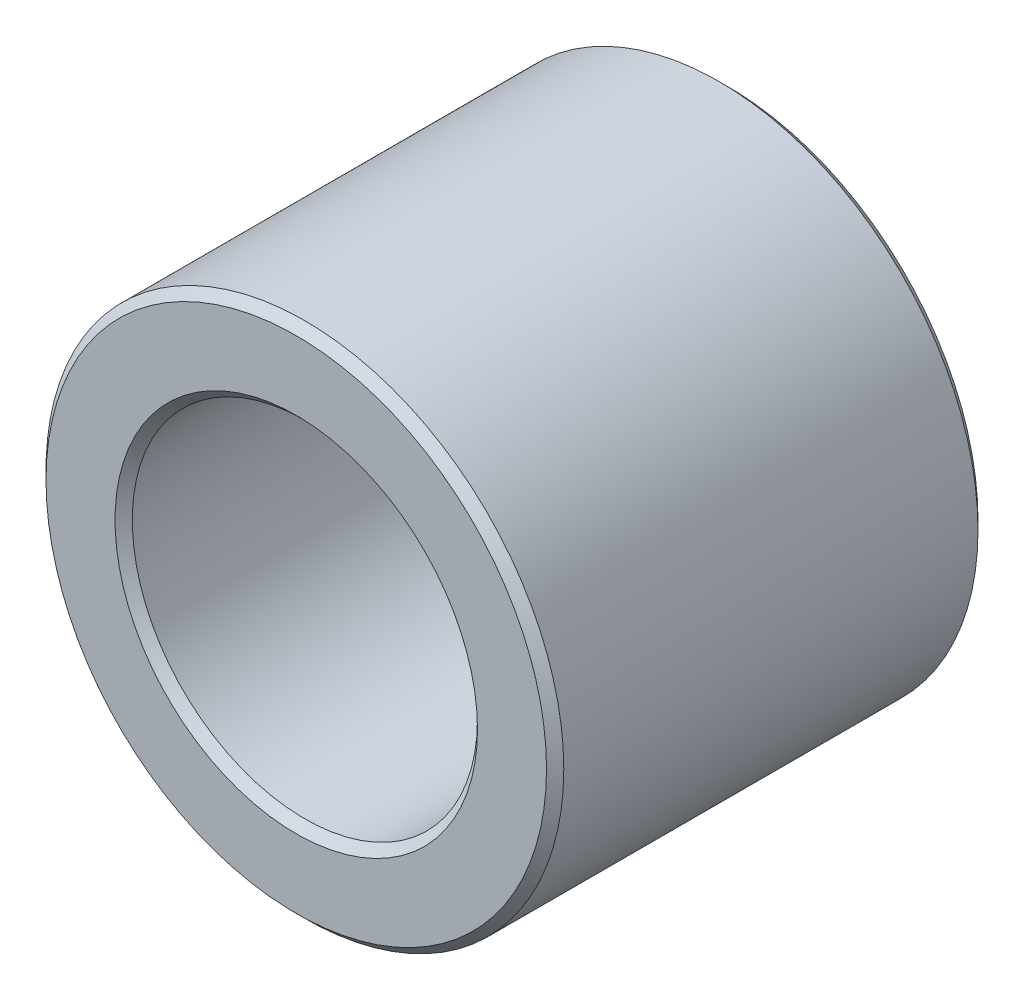
ISO-10303-21;
HEADER;
FILE_DESCRIPTION(('STEP AP214'),'2;1');
FILE_NAME('part.step','',(''),(''),'','','');
FILE_SCHEMA(('AUTOMOTIVE_DESIGN { 1 0 10303 214 1 1 1 1 }'));
ENDSEC;
DATA;
#1=APPLICATION_CONTEXT('core data for automotive mechanical design processes');
#2=APPLICATION_PROTOCOL_DEFINITION('international standard','automotive_design',2000,#1);
#3=PRODUCT_CONTEXT('',#1,'mechanical');
#4=PRODUCT('Part','Part','',(#3));
#5=PRODUCT_RELATED_PRODUCT_CATEGORY('part','',(#4));
#6=PRODUCT_DEFINITION_FORMATION('','',#4);
#7=PRODUCT_DEFINITION_CONTEXT('part definition',#1,'design');
#8=PRODUCT_DEFINITION('design','',#6,#7);
#9=PRODUCT_DEFINITION_SHAPE('','',#8);
#10=(LENGTH_UNIT() NAMED_UNIT(*) SI_UNIT(.MILLI.,.METRE.));
#11=(NAMED_UNIT(*) PLANE_ANGLE_UNIT() SI_UNIT($,.RADIAN.));
#12=(NAMED_UNIT(*) SI_UNIT($,.STERADIAN.) SOLID_ANGLE_UNIT());
#13=UNCERTAINTY_MEASURE_WITH_UNIT(LENGTH_MEASURE(1.E-05),#10,'distance_accuracy_value','');
#14=(GEOMETRIC_REPRESENTATION_CONTEXT(3) GLOBAL_UNCERTAINTY_ASSIGNED_CONTEXT((#13)) GLOBAL_UNIT_ASSIGNED_CONTEXT((#10,
#11,#12)) REPRESENTATION_CONTEXT('',''));
#15=CARTESIAN_POINT('',(0.,0.,0.));
#16=DIRECTION('',(0.,0.,1.));
#17=DIRECTION('',(1.,0.,0.));
#18=AXIS2_PLACEMENT_3D('',#15,#16,#17);
#19=CARTESIAN_POINT('',(0.,0.,10.));
#20=DIRECTION('',(0.,0.,1.));
#21=DIRECTION('',(1.,0.,0.));
#22=AXIS2_PLACEMENT_3D('',#19,#20,#21);
#23=PLANE('',#22);
#24=CARTESIAN_POINT('',(0.,0.,10.));
#25=DIRECTION('',(0.,0.,1.));
#26=DIRECTION('',(1.,0.,0.));
#27=AXIS2_PLACEMENT_3D('',#24,#25,#26);
#28=CIRCLE('',#27,4.2);
#29=CARTESIAN_POINT('',(4.2,0.,10.));
#30=VERTEX_POINT('',#29);
#31=EDGE_CURVE('E10',#30,#30,#28,.F.);
#32=ORIENTED_EDGE('',*,*,#31,.T.);
#33=EDGE_LOOP('',(#32));
#34=FACE_BOUND('',#33,.T.);
#35=CARTESIAN_POINT('',(0.,0.,10.));
#36=DIRECTION('',(0.,0.,1.));
#37=DIRECTION('',(1.,0.,0.));
#38=AXIS2_PLACEMENT_3D('',#35,#36,#37);
#39=CIRCLE('',#38,5.8);
#40=CARTESIAN_POINT('',(5.8,0.,10.));
#41=VERTEX_POINT('',#40);
#42=EDGE_CURVE('E46',#41,#41,#39,.T.);
#43=ORIENTED_EDGE('',*,*,#42,.T.);
#44=EDGE_LOOP('',(#43));
#45=FACE_BOUND('',#44,.T.);
#46=ADVANCED_FACE('F38',(#34,#45),#23,.T.);
#47=CARTESIAN_POINT('',(0.,0.,0.));
#48=DIRECTION('',(0.,0.,1.));
#49=DIRECTION('',(1.,0.,0.));
#50=AXIS2_PLACEMENT_3D('',#47,#48,#49);
#51=PLANE('',#50);
#52=CARTESIAN_POINT('',(0.,0.,0.));
#53=DIRECTION('',(0.,0.,1.));
#54=DIRECTION('',(1.,0.,0.));
#55=AXIS2_PLACEMENT_3D('',#52,#53,#54);
#56=CIRCLE('',#55,4.2);
#57=CARTESIAN_POINT('',(4.2,0.,0.));
#58=VERTEX_POINT('',#57);
#59=EDGE_CURVE('E72',#58,#58,#56,.T.);
#60=ORIENTED_EDGE('',*,*,#59,.T.);
#61=EDGE_LOOP('',(#60));
#62=FACE_BOUND('',#61,.T.);
#63=CARTESIAN_POINT('',(0.,0.,0.));
#64=DIRECTION('',(0.,0.,1.));
#65=DIRECTION('',(1.,0.,0.));
#66=AXIS2_PLACEMENT_3D('',#63,#64,#65);
#67=CIRCLE('',#66,5.8);
#68=CARTESIAN_POINT('',(5.8,0.,0.));
#69=VERTEX_POINT('',#68);
#70=EDGE_CURVE('E76',#69,#69,#67,.F.);
#71=ORIENTED_EDGE('',*,*,#70,.T.);
#72=EDGE_LOOP('',(#71));
#73=FACE_BOUND('',#72,.T.);
#74=ADVANCED_FACE('F82',(#62,#73),#51,.F.);
#75=CARTESIAN_POINT('',(0.,0.,10.));
#76=DIRECTION('',(0.,0.,-1.));
#77=DIRECTION('',(-1.,0.,0.));
#78=AXIS2_PLACEMENT_3D('',#75,#76,#77);
#79=CYLINDRICAL_SURFACE('',#78,6.);
#80=CARTESIAN_POINT('',(0.,0.,0.200000000000001));
#81=DIRECTION('',(0.,0.,1.));
#82=DIRECTION('',(1.,0.,0.));
#83=AXIS2_PLACEMENT_3D('',#80,#81,#82);
#84=CIRCLE('',#83,6.);
#85=CARTESIAN_POINT('',(6.,0.,0.200000000000001));
#86=VERTEX_POINT('',#85);
#87=EDGE_CURVE('E52',#86,#86,#84,.T.);
#88=ORIENTED_EDGE('',*,*,#87,.T.);
#89=EDGE_LOOP('',(#88));
#90=FACE_BOUND('',#89,.T.);
#91=CARTESIAN_POINT('',(0.,0.,9.8));
#92=DIRECTION('',(0.,0.,1.));
#93=DIRECTION('',(1.,0.,0.));
#94=AXIS2_PLACEMENT_3D('',#91,#92,#93);
#95=CIRCLE('',#94,6.);
#96=CARTESIAN_POINT('',(6.,0.,9.8));
#97=VERTEX_POINT('',#96);
#98=EDGE_CURVE('E58',#97,#97,#95,.F.);
#99=ORIENTED_EDGE('',*,*,#98,.T.);
#100=EDGE_LOOP('',(#99));
#101=FACE_BOUND('',#100,.T.);
#102=ADVANCED_FACE('F92',(#90,#101),#79,.T.);
#103=CARTESIAN_POINT('',(0.,0.,10.));
#104=DIRECTION('',(0.,0.,-1.));
#105=DIRECTION('',(-1.,0.,0.));
#106=AXIS2_PLACEMENT_3D('',#103,#104,#105);
#107=CYLINDRICAL_SURFACE('',#106,4.);
#108=CARTESIAN_POINT('',(0.,0.,0.200000000000001));
#109=DIRECTION('',(0.,0.,1.));
#110=DIRECTION('',(1.,0.,0.));
#111=AXIS2_PLACEMENT_3D('',#108,#109,#110);
#112=CIRCLE('',#111,4.);
#113=CARTESIAN_POINT('',(4.,0.,0.200000000000001));
#114=VERTEX_POINT('',#113);
#115=EDGE_CURVE('E64',#114,#114,#112,.F.);
#116=ORIENTED_EDGE('',*,*,#115,.T.);
#117=EDGE_LOOP('',(#116));
#118=FACE_BOUND('',#117,.T.);
#119=CARTESIAN_POINT('',(0.,0.,9.8));
#120=DIRECTION('',(0.,0.,1.));
#121=DIRECTION('',(1.,0.,0.));
#122=AXIS2_PLACEMENT_3D('',#119,#120,#121);
#123=CIRCLE('',#122,4.);
#124=CARTESIAN_POINT('',(4.,0.,9.8));
#125=VERTEX_POINT('',#124);
#126=EDGE_CURVE('E68',#125,#125,#123,.T.);
#127=ORIENTED_EDGE('',*,*,#126,.T.);
#128=EDGE_LOOP('',(#127));
#129=FACE_BOUND('',#128,.T.);
#130=ADVANCED_FACE('F95',(#118,#129),#107,.F.);
#131=CARTESIAN_POINT('',(0.,0.,0.));
#132=DIRECTION('',(0.,0.,-1.));
#133=DIRECTION('',(-1.,0.,0.));
#134=AXIS2_PLACEMENT_3D('',#131,#132,#133);
#135=CONICAL_SURFACE('',#134,4.2,0.785398163397448);
#136=ORIENTED_EDGE('',*,*,#115,.F.);
#137=EDGE_LOOP('',(#136));
#138=FACE_BOUND('',#137,.T.);
#139=ORIENTED_EDGE('',*,*,#59,.F.);
#140=EDGE_LOOP('',(#139));
#141=FACE_BOUND('',#140,.T.);
#142=ADVANCED_FACE('F88',(#138,#141),#135,.F.);
#143=CARTESIAN_POINT('',(0.,0.,0.200000000000001));
#144=DIRECTION('',(0.,0.,1.));
#145=DIRECTION('',(1.,0.,0.));
#146=AXIS2_PLACEMENT_3D('',#143,#144,#145);
#147=CONICAL_SURFACE('',#146,6.,0.785398163397448);
#148=ORIENTED_EDGE('',*,*,#70,.F.);
#149=EDGE_LOOP('',(#148));
#150=FACE_BOUND('',#149,.T.);
#151=ORIENTED_EDGE('',*,*,#87,.F.);
#152=EDGE_LOOP('',(#151));
#153=FACE_BOUND('',#152,.T.);
#154=ADVANCED_FACE('F84',(#150,#153),#147,.T.);
#155=CARTESIAN_POINT('',(0.,0.,9.8));
#156=DIRECTION('',(0.,0.,1.));
#157=DIRECTION('',(1.,0.,0.));
#158=AXIS2_PLACEMENT_3D('',#155,#156,#157);
#159=CONICAL_SURFACE('',#158,4.,0.785398163397444);
#160=ORIENTED_EDGE('',*,*,#31,.F.);
#161=EDGE_LOOP('',(#160));
#162=FACE_BOUND('',#161,.T.);
#163=ORIENTED_EDGE('',*,*,#126,.F.);
#164=EDGE_LOOP('',(#163));
#165=FACE_BOUND('',#164,.T.);
#166=ADVANCED_FACE('F87',(#162,#165),#159,.F.);
#167=CARTESIAN_POINT('',(0.,0.,10.));
#168=DIRECTION('',(0.,0.,-1.));
#169=DIRECTION('',(-1.,0.,0.));
#170=AXIS2_PLACEMENT_3D('',#167,#168,#169);
#171=CONICAL_SURFACE('',#170,5.8,0.785398163397453);
#172=ORIENTED_EDGE('',*,*,#98,.F.);
#173=EDGE_LOOP('',(#172));
#174=FACE_BOUND('',#173,.T.);
#175=ORIENTED_EDGE('',*,*,#42,.F.);
#176=EDGE_LOOP('',(#175));
#177=FACE_BOUND('',#176,.T.);
#178=ADVANCED_FACE('F40',(#174,#177),#171,.T.);
#179=CLOSED_SHELL('',(#46,#74,#102,#130,#142,#154,#166,#178));
#180=MANIFOLD_SOLID_BREP('B2',#179);
#181=ADVANCED_BREP_SHAPE_REPRESENTATION('',(#18,#180),#14);
#182=SHAPE_DEFINITION_REPRESENTATION(#9,#181);
ENDSEC;
END-ISO-10303-21;
